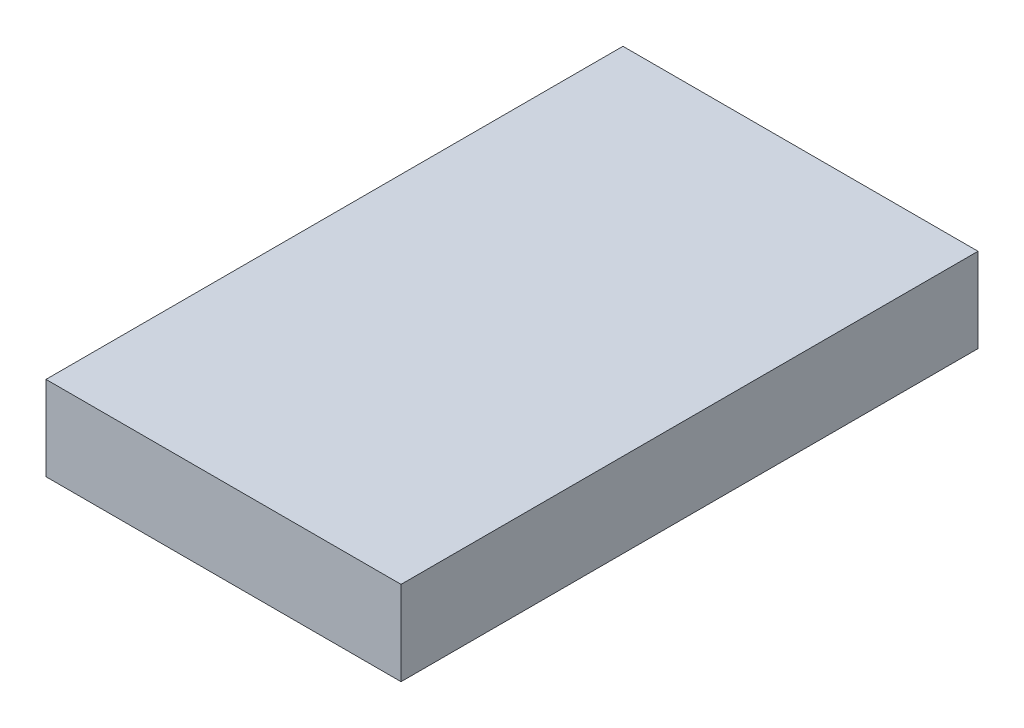
ISO-10303-21;
HEADER;
FILE_DESCRIPTION(('STEP AP214'),'2;1');
FILE_NAME('part.step','',(''),(''),'','','');
FILE_SCHEMA(('AUTOMOTIVE_DESIGN { 1 0 10303 214 1 1 1 1 }'));
ENDSEC;
DATA;
#1=APPLICATION_CONTEXT('core data for automotive mechanical design processes');
#2=APPLICATION_PROTOCOL_DEFINITION('international standard','automotive_design',2000,#1);
#3=PRODUCT_CONTEXT('',#1,'mechanical');
#4=PRODUCT('Part','Part','',(#3));
#5=PRODUCT_RELATED_PRODUCT_CATEGORY('part','',(#4));
#6=PRODUCT_DEFINITION_FORMATION('','',#4);
#7=PRODUCT_DEFINITION_CONTEXT('part definition',#1,'design');
#8=PRODUCT_DEFINITION('design','',#6,#7);
#9=PRODUCT_DEFINITION_SHAPE('','',#8);
#10=(LENGTH_UNIT() NAMED_UNIT(*) SI_UNIT(.MILLI.,.METRE.));
#11=(NAMED_UNIT(*) PLANE_ANGLE_UNIT() SI_UNIT($,.RADIAN.));
#12=(NAMED_UNIT(*) SI_UNIT($,.STERADIAN.) SOLID_ANGLE_UNIT());
#13=UNCERTAINTY_MEASURE_WITH_UNIT(LENGTH_MEASURE(1.E-05),#10,'distance_accuracy_value','');
#14=(GEOMETRIC_REPRESENTATION_CONTEXT(3) GLOBAL_UNCERTAINTY_ASSIGNED_CONTEXT((#13)) GLOBAL_UNIT_ASSIGNED_CONTEXT((#10,
#11,#12)) REPRESENTATION_CONTEXT('',''));
#15=CARTESIAN_POINT('',(0.,0.,0.));
#16=DIRECTION('',(0.,0.,1.));
#17=DIRECTION('',(1.,0.,0.));
#18=AXIS2_PLACEMENT_3D('',#15,#16,#17);
#19=CARTESIAN_POINT('',(0.,0.,260.));
#20=DIRECTION('',(1.,0.,0.));
#21=DIRECTION('',(0.,0.,-1.));
#22=AXIS2_PLACEMENT_3D('',#19,#20,#21);
#23=PLANE('',#22);
#24=DIRECTION('',(0.,-1.,0.));
#25=VECTOR('',#24,1.);
#26=CARTESIAN_POINT('',(0.,0.,0.));
#27=LINE('',#26,#25);
#28=CARTESIAN_POINT('',(0.,38.,0.));
#29=VERTEX_POINT('',#28);
#30=CARTESIAN_POINT('',(0.,0.,0.));
#31=VERTEX_POINT('',#30);
#32=EDGE_CURVE('E95',#29,#31,#27,.T.);
#33=ORIENTED_EDGE('',*,*,#32,.T.);
#34=DIRECTION('',(0.,0.,-1.));
#35=VECTOR('',#34,1.);
#36=CARTESIAN_POINT('',(0.,0.,260.));
#37=LINE('',#36,#35);
#38=CARTESIAN_POINT('',(0.,0.,260.));
#39=VERTEX_POINT('',#38);
#40=EDGE_CURVE('E11',#39,#31,#37,.T.);
#41=ORIENTED_EDGE('',*,*,#40,.F.);
#42=DIRECTION('',(0.,-1.,0.));
#43=VECTOR('',#42,1.);
#44=CARTESIAN_POINT('',(0.,0.,260.));
#45=LINE('',#44,#43);
#46=CARTESIAN_POINT('',(0.,38.,260.));
#47=VERTEX_POINT('',#46);
#48=EDGE_CURVE('E83',#47,#39,#45,.T.);
#49=ORIENTED_EDGE('',*,*,#48,.F.);
#50=DIRECTION('',(0.,0.,-1.));
#51=VECTOR('',#50,1.);
#52=CARTESIAN_POINT('',(0.,38.,260.));
#53=LINE('',#52,#51);
#54=EDGE_CURVE('E91',#47,#29,#53,.T.);
#55=ORIENTED_EDGE('',*,*,#54,.T.);
#56=EDGE_LOOP('',(#33,#41,#49,#55));
#57=FACE_BOUND('',#56,.T.);
#58=ADVANCED_FACE('F32',(#57),#23,.F.);
#59=CARTESIAN_POINT('',(0.,0.,260.));
#60=DIRECTION('',(0.,1.,0.));
#61=DIRECTION('',(0.,0.,1.));
#62=AXIS2_PLACEMENT_3D('',#59,#60,#61);
#63=PLANE('',#62);
#64=DIRECTION('',(1.,0.,0.));
#65=VECTOR('',#64,1.);
#66=CARTESIAN_POINT('',(0.,0.,0.));
#67=LINE('',#66,#65);
#68=CARTESIAN_POINT('',(160.,0.,0.));
#69=VERTEX_POINT('',#68);
#70=EDGE_CURVE('E87',#31,#69,#67,.T.);
#71=ORIENTED_EDGE('',*,*,#70,.T.);
#72=DIRECTION('',(0.,0.,-1.));
#73=VECTOR('',#72,1.);
#74=CARTESIAN_POINT('',(160.,0.,260.));
#75=LINE('',#74,#73);
#76=CARTESIAN_POINT('',(160.,0.,260.));
#77=VERTEX_POINT('',#76);
#78=EDGE_CURVE('E40',#77,#69,#75,.T.);
#79=ORIENTED_EDGE('',*,*,#78,.F.);
#80=DIRECTION('',(1.,0.,0.));
#81=VECTOR('',#80,1.);
#82=CARTESIAN_POINT('',(0.,0.,260.));
#83=LINE('',#82,#81);
#84=EDGE_CURVE('E78',#39,#77,#83,.T.);
#85=ORIENTED_EDGE('',*,*,#84,.F.);
#86=ORIENTED_EDGE('',*,*,#40,.T.);
#87=EDGE_LOOP('',(#71,#79,#85,#86));
#88=FACE_BOUND('',#87,.T.);
#89=ADVANCED_FACE('F86',(#88),#63,.F.);
#90=CARTESIAN_POINT('',(160.,0.,260.));
#91=DIRECTION('',(-1.,0.,0.));
#92=DIRECTION('',(0.,0.,1.));
#93=AXIS2_PLACEMENT_3D('',#90,#91,#92);
#94=PLANE('',#93);
#95=DIRECTION('',(0.,1.,0.));
#96=VECTOR('',#95,1.);
#97=CARTESIAN_POINT('',(160.,0.,0.));
#98=LINE('',#97,#96);
#99=CARTESIAN_POINT('',(160.,38.,0.));
#100=VERTEX_POINT('',#99);
#101=EDGE_CURVE('E65',#69,#100,#98,.T.);
#102=ORIENTED_EDGE('',*,*,#101,.T.);
#103=DIRECTION('',(0.,0.,-1.));
#104=VECTOR('',#103,1.);
#105=CARTESIAN_POINT('',(160.,38.,260.));
#106=LINE('',#105,#104);
#107=CARTESIAN_POINT('',(160.,38.,260.));
#108=VERTEX_POINT('',#107);
#109=EDGE_CURVE('E88',#108,#100,#106,.T.);
#110=ORIENTED_EDGE('',*,*,#109,.F.);
#111=DIRECTION('',(0.,1.,0.));
#112=VECTOR('',#111,1.);
#113=CARTESIAN_POINT('',(160.,0.,260.));
#114=LINE('',#113,#112);
#115=EDGE_CURVE('E81',#77,#108,#114,.T.);
#116=ORIENTED_EDGE('',*,*,#115,.F.);
#117=ORIENTED_EDGE('',*,*,#78,.T.);
#118=EDGE_LOOP('',(#102,#110,#116,#117));
#119=FACE_BOUND('',#118,.T.);
#120=ADVANCED_FACE('F89',(#119),#94,.F.);
#121=CARTESIAN_POINT('',(0.,38.,260.));
#122=DIRECTION('',(0.,-1.,0.));
#123=DIRECTION('',(0.,0.,-1.));
#124=AXIS2_PLACEMENT_3D('',#121,#122,#123);
#125=PLANE('',#124);
#126=DIRECTION('',(-1.,0.,0.));
#127=VECTOR('',#126,1.);
#128=CARTESIAN_POINT('',(0.,38.,0.));
#129=LINE('',#128,#127);
#130=EDGE_CURVE('E71',#100,#29,#129,.T.);
#131=ORIENTED_EDGE('',*,*,#130,.T.);
#132=ORIENTED_EDGE('',*,*,#54,.F.);
#133=DIRECTION('',(-1.,0.,0.));
#134=VECTOR('',#133,1.);
#135=CARTESIAN_POINT('',(0.,38.,260.));
#136=LINE('',#135,#134);
#137=EDGE_CURVE('E48',#108,#47,#136,.T.);
#138=ORIENTED_EDGE('',*,*,#137,.F.);
#139=ORIENTED_EDGE('',*,*,#109,.T.);
#140=EDGE_LOOP('',(#131,#132,#138,#139));
#141=FACE_BOUND('',#140,.T.);
#142=ADVANCED_FACE('F102',(#141),#125,.F.);
#143=CARTESIAN_POINT('',(0.,0.,260.));
#144=DIRECTION('',(0.,0.,-1.));
#145=DIRECTION('',(-1.,0.,0.));
#146=AXIS2_PLACEMENT_3D('',#143,#144,#145);
#147=PLANE('',#146);
#148=ORIENTED_EDGE('',*,*,#48,.T.);
#149=ORIENTED_EDGE('',*,*,#84,.T.);
#150=ORIENTED_EDGE('',*,*,#115,.T.);
#151=ORIENTED_EDGE('',*,*,#137,.T.);
#152=EDGE_LOOP('',(#148,#149,#150,#151));
#153=FACE_BOUND('',#152,.T.);
#154=ADVANCED_FACE('F79',(#153),#147,.F.);
#155=CARTESIAN_POINT('',(0.,0.,0.));
#156=DIRECTION('',(0.,0.,-1.));
#157=DIRECTION('',(-1.,0.,0.));
#158=AXIS2_PLACEMENT_3D('',#155,#156,#157);
#159=PLANE('',#158);
#160=ORIENTED_EDGE('',*,*,#32,.F.);
#161=ORIENTED_EDGE('',*,*,#130,.F.);
#162=ORIENTED_EDGE('',*,*,#101,.F.);
#163=ORIENTED_EDGE('',*,*,#70,.F.);
#164=EDGE_LOOP('',(#160,#161,#162,#163));
#165=FACE_BOUND('',#164,.T.);
#166=ADVANCED_FACE('F105',(#165),#159,.T.);
#167=CLOSED_SHELL('',(#58,#89,#120,#142,#154,#166));
#168=MANIFOLD_SOLID_BREP('B2',#167);
#169=ADVANCED_BREP_SHAPE_REPRESENTATION('',(#18,#168),#14);
#170=SHAPE_DEFINITION_REPRESENTATION(#9,#169);
ENDSEC;
END-ISO-10303-21;
